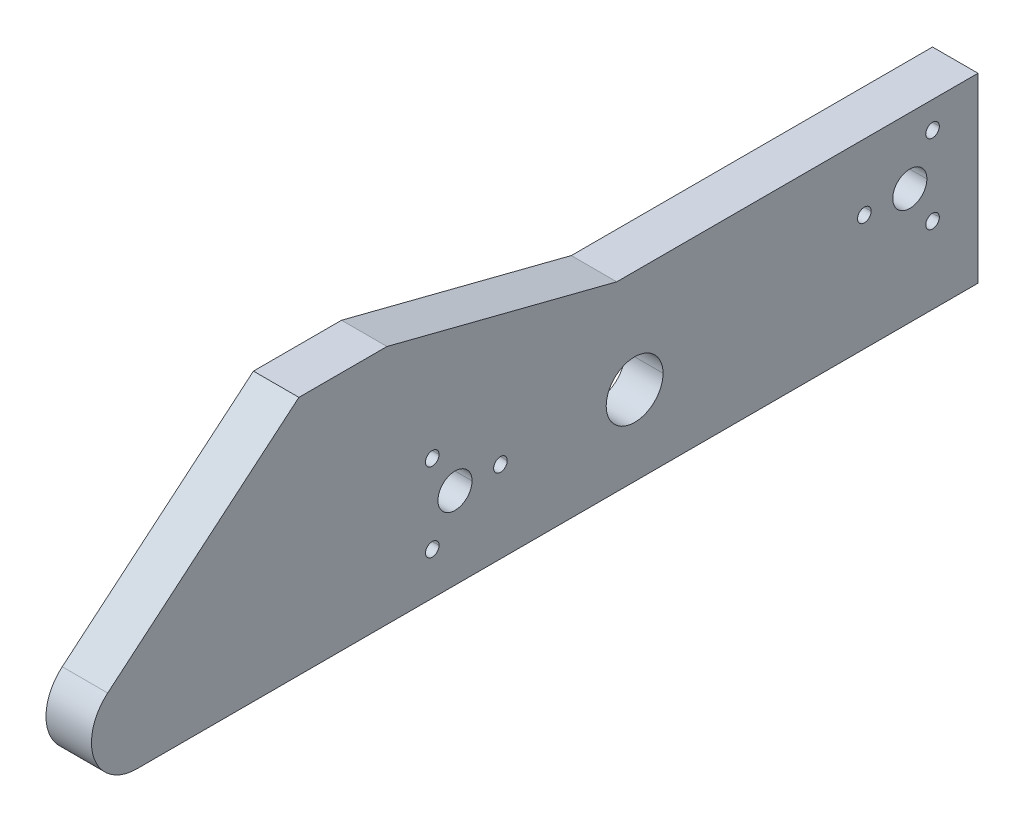
ISO-10303-21;
HEADER;
FILE_DESCRIPTION(('STEP AP214'),'2;1');
FILE_NAME('part.step','',(''),(''),'','','');
FILE_SCHEMA(('AUTOMOTIVE_DESIGN { 1 0 10303 214 1 1 1 1 }'));
ENDSEC;
DATA;
#1=APPLICATION_CONTEXT('core data for automotive mechanical design processes');
#2=APPLICATION_PROTOCOL_DEFINITION('international standard','automotive_design',2000,#1);
#3=PRODUCT_CONTEXT('',#1,'mechanical');
#4=PRODUCT('Part','Part','',(#3));
#5=PRODUCT_RELATED_PRODUCT_CATEGORY('part','',(#4));
#6=PRODUCT_DEFINITION_FORMATION('','',#4);
#7=PRODUCT_DEFINITION_CONTEXT('part definition',#1,'design');
#8=PRODUCT_DEFINITION('design','',#6,#7);
#9=PRODUCT_DEFINITION_SHAPE('','',#8);
#10=(LENGTH_UNIT() NAMED_UNIT(*) SI_UNIT(.MILLI.,.METRE.));
#11=(NAMED_UNIT(*) PLANE_ANGLE_UNIT() SI_UNIT($,.RADIAN.));
#12=(NAMED_UNIT(*) SI_UNIT($,.STERADIAN.) SOLID_ANGLE_UNIT());
#13=UNCERTAINTY_MEASURE_WITH_UNIT(LENGTH_MEASURE(1.E-05),#10,'distance_accuracy_value','');
#14=(GEOMETRIC_REPRESENTATION_CONTEXT(3) GLOBAL_UNCERTAINTY_ASSIGNED_CONTEXT((#13)) GLOBAL_UNIT_ASSIGNED_CONTEXT((#10,
#11,#12)) REPRESENTATION_CONTEXT('',''));
#15=CARTESIAN_POINT('',(0.,0.,0.));
#16=DIRECTION('',(0.,0.,1.));
#17=DIRECTION('',(1.,0.,0.));
#18=AXIS2_PLACEMENT_3D('',#15,#16,#17);
#19=CARTESIAN_POINT('',(208.574999918,-10.16,76.8697838803578));
#20=DIRECTION('',(-1.,0.,0.));
#21=DIRECTION('',(0.,0.,1.));
#22=AXIS2_PLACEMENT_3D('',#19,#20,#21);
#23=PLANE('',#22);
#24=CARTESIAN_POINT('',(208.574999918,-10.16,76.8697838803578));
#25=DIRECTION('',(-1.,0.,0.));
#26=DIRECTION('',(0.,0.,1.));
#27=AXIS2_PLACEMENT_3D('',#24,#25,#26);
#28=CIRCLE('',#27,7.9375);
#29=CARTESIAN_POINT('',(208.574999918,-10.16,84.8072838803578));
#30=VERTEX_POINT('',#29);
#31=CARTESIAN_POINT('',(208.574999918,-10.16,68.9322838803578));
#32=VERTEX_POINT('',#31);
#33=EDGE_CURVE('E278',#30,#32,#28,.T.);
#34=ORIENTED_EDGE('',*,*,#33,.F.);
#35=CARTESIAN_POINT('',(208.574999918,-10.16,76.8697838803578));
#36=DIRECTION('',(-1.,0.,0.));
#37=DIRECTION('',(0.,0.,1.));
#38=AXIS2_PLACEMENT_3D('',#35,#36,#37);
#39=CIRCLE('',#38,7.9375);
#40=EDGE_CURVE('E399',#32,#30,#39,.T.);
#41=ORIENTED_EDGE('',*,*,#40,.F.);
#42=EDGE_LOOP('',(#34,#41));
#43=FACE_BOUND('',#42,.T.);
#44=CARTESIAN_POINT('',(208.574999918,-10.16,76.8697838803578));
#45=DIRECTION('',(-1.,0.,0.));
#46=DIRECTION('',(0.,0.,1.));
#47=AXIS2_PLACEMENT_3D('',#44,#45,#46);
#48=CIRCLE('',#47,17.563500052);
#49=CARTESIAN_POINT('',(208.574999918,-10.16,94.4332839323578));
#50=VERTEX_POINT('',#49);
#51=CARTESIAN_POINT('',(208.574999918,-10.16,59.3062838283578));
#52=VERTEX_POINT('',#51);
#53=EDGE_CURVE('E10',#50,#52,#48,.T.);
#54=ORIENTED_EDGE('',*,*,#53,.T.);
#55=CARTESIAN_POINT('',(208.574999918,-10.16,76.8697838803578));
#56=DIRECTION('',(-1.,0.,0.));
#57=DIRECTION('',(0.,0.,1.));
#58=AXIS2_PLACEMENT_3D('',#55,#56,#57);
#59=CIRCLE('',#58,17.563500052);
#60=EDGE_CURVE('E469',#52,#50,#59,.T.);
#61=ORIENTED_EDGE('',*,*,#60,.T.);
#62=EDGE_LOOP('',(#54,#61));
#63=FACE_BOUND('',#62,.T.);
#64=ADVANCED_FACE('F15',(#43,#63),#23,.T.);
#65=CARTESIAN_POINT('',(208.574999918,-10.16,76.8697838803578));
#66=DIRECTION('',(-1.,0.,0.));
#67=DIRECTION('',(0.,0.,1.));
#68=AXIS2_PLACEMENT_3D('',#65,#66,#67);
#69=CYLINDRICAL_SURFACE('',#68,17.563500052);
#70=DIRECTION('',(-1.,0.,0.));
#71=VECTOR('',#70,1.);
#72=CARTESIAN_POINT('',(208.574999918,-10.16,59.3062838283578));
#73=LINE('',#72,#71);
#74=CARTESIAN_POINT('',(206.375,-10.16,59.3062838283578));
#75=VERTEX_POINT('',#74);
#76=EDGE_CURVE('E288',#52,#75,#73,.T.);
#77=ORIENTED_EDGE('',*,*,#76,.F.);
#78=ORIENTED_EDGE('',*,*,#53,.F.);
#79=DIRECTION('',(-1.,0.,0.));
#80=VECTOR('',#79,1.);
#81=CARTESIAN_POINT('',(208.574999918,-10.16,94.4332839323578));
#82=LINE('',#81,#80);
#83=CARTESIAN_POINT('',(206.375,-10.16,94.4332839323578));
#84=VERTEX_POINT('',#83);
#85=EDGE_CURVE('E287',#50,#84,#82,.T.);
#86=ORIENTED_EDGE('',*,*,#85,.T.);
#87=CARTESIAN_POINT('',(206.375,-10.16,76.8697838803578));
#88=DIRECTION('',(-1.,0.,0.));
#89=DIRECTION('',(0.,0.,1.));
#90=AXIS2_PLACEMENT_3D('',#87,#88,#89);
#91=CIRCLE('',#90,17.563500052);
#92=EDGE_CURVE('E342',#84,#75,#91,.T.);
#93=ORIENTED_EDGE('',*,*,#92,.T.);
#94=EDGE_LOOP('',(#77,#78,#86,#93));
#95=FACE_BOUND('',#94,.T.);
#96=ADVANCED_FACE('F496',(#95),#69,.F.);
#97=CARTESIAN_POINT('',(219.075,1.47352262806237,133.396275802921));
#98=DIRECTION('',(1.,0.,0.));
#99=DIRECTION('',(0.,0.,-1.));
#100=AXIS2_PLACEMENT_3D('',#97,#98,#99);
#101=CYLINDRICAL_SURFACE('',#100,1.89865);
#102=DIRECTION('',(1.,0.,0.));
#103=VECTOR('',#102,1.);
#104=CARTESIAN_POINT('',(219.075,1.47352262806237,135.294925802921));
#105=LINE('',#104,#103);
#106=CARTESIAN_POINT('',(206.375,1.47352262806237,135.294925802921));
#107=VERTEX_POINT('',#106);
#108=CARTESIAN_POINT('',(219.075,1.47352262806237,135.294925802921));
#109=VERTEX_POINT('',#108);
#110=EDGE_CURVE('E330',#107,#109,#105,.T.);
#111=ORIENTED_EDGE('',*,*,#110,.F.);
#112=CARTESIAN_POINT('',(206.375,1.47352262806237,133.396275802921));
#113=DIRECTION('',(-1.,0.,0.));
#114=DIRECTION('',(0.,0.,1.));
#115=AXIS2_PLACEMENT_3D('',#112,#113,#114);
#116=CIRCLE('',#115,1.89865);
#117=CARTESIAN_POINT('',(206.375,1.47352262806237,131.497625802921));
#118=VERTEX_POINT('',#117);
#119=EDGE_CURVE('E339',#107,#118,#116,.T.);
#120=ORIENTED_EDGE('',*,*,#119,.T.);
#121=DIRECTION('',(1.,0.,0.));
#122=VECTOR('',#121,1.);
#123=CARTESIAN_POINT('',(219.075,1.47352262806237,131.497625802921));
#124=LINE('',#123,#122);
#125=CARTESIAN_POINT('',(219.075,1.47352262806237,131.497625802921));
#126=VERTEX_POINT('',#125);
#127=EDGE_CURVE('E352',#118,#126,#124,.T.);
#128=ORIENTED_EDGE('',*,*,#127,.T.);
#129=CARTESIAN_POINT('',(219.075,1.47352262806237,133.396275802921));
#130=DIRECTION('',(1.,0.,0.));
#131=DIRECTION('',(0.,0.,-1.));
#132=AXIS2_PLACEMENT_3D('',#129,#130,#131);
#133=CIRCLE('',#132,1.89865);
#134=EDGE_CURVE('E259',#126,#109,#133,.T.);
#135=ORIENTED_EDGE('',*,*,#134,.T.);
#136=EDGE_LOOP('',(#111,#120,#128,#135));
#137=FACE_BOUND('',#136,.T.);
#138=ADVANCED_FACE('F1019',(#137),#101,.F.);
#139=CARTESIAN_POINT('',(219.075,-20.5235226280624,133.396275802921));
#140=DIRECTION('',(1.,0.,0.));
#141=DIRECTION('',(0.,0.,-1.));
#142=AXIS2_PLACEMENT_3D('',#139,#140,#141);
#143=CYLINDRICAL_SURFACE('',#142,1.89865);
#144=DIRECTION('',(1.,0.,0.));
#145=VECTOR('',#144,1.);
#146=CARTESIAN_POINT('',(219.075,-20.5235226280624,135.294925802921));
#147=LINE('',#146,#145);
#148=CARTESIAN_POINT('',(206.375,-20.5235226280624,135.294925802921));
#149=VERTEX_POINT('',#148);
#150=CARTESIAN_POINT('',(219.075,-20.5235226280624,135.294925802921));
#151=VERTEX_POINT('',#150);
#152=EDGE_CURVE('E373',#149,#151,#147,.T.);
#153=ORIENTED_EDGE('',*,*,#152,.F.);
#154=CARTESIAN_POINT('',(206.375,-20.5235226280624,133.396275802921));
#155=DIRECTION('',(-1.,0.,0.));
#156=DIRECTION('',(0.,0.,1.));
#157=AXIS2_PLACEMENT_3D('',#154,#155,#156);
#158=CIRCLE('',#157,1.89865);
#159=CARTESIAN_POINT('',(206.375,-20.5235226280624,131.497625802921));
#160=VERTEX_POINT('',#159);
#161=EDGE_CURVE('E341',#149,#160,#158,.T.);
#162=ORIENTED_EDGE('',*,*,#161,.T.);
#163=DIRECTION('',(1.,0.,0.));
#164=VECTOR('',#163,1.);
#165=CARTESIAN_POINT('',(219.075,-20.5235226280624,131.497625802921));
#166=LINE('',#165,#164);
#167=CARTESIAN_POINT('',(219.075,-20.5235226280624,131.497625802921));
#168=VERTEX_POINT('',#167);
#169=EDGE_CURVE('E433',#160,#168,#166,.T.);
#170=ORIENTED_EDGE('',*,*,#169,.T.);
#171=CARTESIAN_POINT('',(219.075,-20.5235226280624,133.396275802921));
#172=DIRECTION('',(1.,0.,0.));
#173=DIRECTION('',(0.,0.,-1.));
#174=AXIS2_PLACEMENT_3D('',#171,#172,#173);
#175=CIRCLE('',#174,1.89865);
#176=EDGE_CURVE('E440',#168,#151,#175,.T.);
#177=ORIENTED_EDGE('',*,*,#176,.T.);
#178=EDGE_LOOP('',(#153,#162,#170,#177));
#179=FACE_BOUND('',#178,.T.);
#180=ADVANCED_FACE('F791',(#179),#143,.F.);
#181=CARTESIAN_POINT('',(219.075,-9.525,114.346275802921));
#182=DIRECTION('',(1.,0.,0.));
#183=DIRECTION('',(0.,0.,-1.));
#184=AXIS2_PLACEMENT_3D('',#181,#182,#183);
#185=CYLINDRICAL_SURFACE('',#184,1.89865);
#186=DIRECTION('',(1.,0.,0.));
#187=VECTOR('',#186,1.);
#188=CARTESIAN_POINT('',(219.075,-9.525,116.244925802921));
#189=LINE('',#188,#187);
#190=CARTESIAN_POINT('',(206.375,-9.525,116.244925802921));
#191=VERTEX_POINT('',#190);
#192=CARTESIAN_POINT('',(219.075,-9.525,116.244925802921));
#193=VERTEX_POINT('',#192);
#194=EDGE_CURVE('E419',#191,#193,#189,.T.);
#195=ORIENTED_EDGE('',*,*,#194,.F.);
#196=CARTESIAN_POINT('',(206.375,-9.525,114.346275802921));
#197=DIRECTION('',(-1.,0.,0.));
#198=DIRECTION('',(0.,0.,1.));
#199=AXIS2_PLACEMENT_3D('',#196,#197,#198);
#200=CIRCLE('',#199,1.89865);
#201=CARTESIAN_POINT('',(206.375,-9.525,112.447625802921));
#202=VERTEX_POINT('',#201);
#203=EDGE_CURVE('E468',#191,#202,#200,.T.);
#204=ORIENTED_EDGE('',*,*,#203,.T.);
#205=DIRECTION('',(1.,0.,0.));
#206=VECTOR('',#205,1.);
#207=CARTESIAN_POINT('',(219.075,-9.525,112.447625802921));
#208=LINE('',#207,#206);
#209=CARTESIAN_POINT('',(219.075,-9.525,112.447625802921));
#210=VERTEX_POINT('',#209);
#211=EDGE_CURVE('E418',#202,#210,#208,.T.);
#212=ORIENTED_EDGE('',*,*,#211,.T.);
#213=CARTESIAN_POINT('',(219.075,-9.525,114.346275802921));
#214=DIRECTION('',(1.,0.,0.));
#215=DIRECTION('',(0.,0.,-1.));
#216=AXIS2_PLACEMENT_3D('',#213,#214,#215);
#217=CIRCLE('',#216,1.89865);
#218=EDGE_CURVE('E309',#210,#193,#217,.T.);
#219=ORIENTED_EDGE('',*,*,#218,.T.);
#220=EDGE_LOOP('',(#195,#204,#212,#219));
#221=FACE_BOUND('',#220,.T.);
#222=ADVANCED_FACE('F17',(#221),#185,.F.);
#223=CARTESIAN_POINT('',(219.075,10.9985226280624,-6.35));
#224=DIRECTION('',(1.,0.,0.));
#225=DIRECTION('',(0.,0.,-1.));
#226=AXIS2_PLACEMENT_3D('',#223,#224,#225);
#227=CYLINDRICAL_SURFACE('',#226,1.89865);
#228=DIRECTION('',(1.,0.,0.));
#229=VECTOR('',#228,1.);
#230=CARTESIAN_POINT('',(219.075,10.9985226280624,-4.45135));
#231=LINE('',#230,#229);
#232=CARTESIAN_POINT('',(206.375,10.9985226280624,-4.45135));
#233=VERTEX_POINT('',#232);
#234=CARTESIAN_POINT('',(219.075,10.9985226280624,-4.45135));
#235=VERTEX_POINT('',#234);
#236=EDGE_CURVE('E260',#233,#235,#231,.T.);
#237=ORIENTED_EDGE('',*,*,#236,.F.);
#238=CARTESIAN_POINT('',(206.375,10.9985226280624,-6.35));
#239=DIRECTION('',(-1.,0.,0.));
#240=DIRECTION('',(0.,0.,1.));
#241=AXIS2_PLACEMENT_3D('',#238,#239,#240);
#242=CIRCLE('',#241,1.89865);
#243=CARTESIAN_POINT('',(206.375,10.9985226280624,-8.24865));
#244=VERTEX_POINT('',#243);
#245=EDGE_CURVE('E324',#233,#244,#242,.T.);
#246=ORIENTED_EDGE('',*,*,#245,.T.);
#247=DIRECTION('',(1.,0.,0.));
#248=VECTOR('',#247,1.);
#249=CARTESIAN_POINT('',(219.075,10.9985226280624,-8.24865));
#250=LINE('',#249,#248);
#251=CARTESIAN_POINT('',(219.075,10.9985226280624,-8.24865));
#252=VERTEX_POINT('',#251);
#253=EDGE_CURVE('E289',#244,#252,#250,.T.);
#254=ORIENTED_EDGE('',*,*,#253,.T.);
#255=CARTESIAN_POINT('',(219.075,10.9985226280624,-6.35));
#256=DIRECTION('',(1.,0.,0.));
#257=DIRECTION('',(0.,0.,-1.));
#258=AXIS2_PLACEMENT_3D('',#255,#256,#257);
#259=CIRCLE('',#258,1.89865);
#260=EDGE_CURVE('E306',#252,#235,#259,.T.);
#261=ORIENTED_EDGE('',*,*,#260,.T.);
#262=EDGE_LOOP('',(#237,#246,#254,#261));
#263=FACE_BOUND('',#262,.T.);
#264=ADVANCED_FACE('F779',(#263),#227,.F.);
#265=CARTESIAN_POINT('',(219.075,0.,12.7));
#266=DIRECTION('',(1.,0.,0.));
#267=DIRECTION('',(0.,0.,-1.));
#268=AXIS2_PLACEMENT_3D('',#265,#266,#267);
#269=CYLINDRICAL_SURFACE('',#268,1.89865);
#270=DIRECTION('',(1.,0.,0.));
#271=VECTOR('',#270,1.);
#272=CARTESIAN_POINT('',(219.075,0.,14.59865));
#273=LINE('',#272,#271);
#274=CARTESIAN_POINT('',(206.375,0.,14.59865));
#275=VERTEX_POINT('',#274);
#276=CARTESIAN_POINT('',(219.075,0.,14.59865));
#277=VERTEX_POINT('',#276);
#278=EDGE_CURVE('E386',#275,#277,#273,.T.);
#279=ORIENTED_EDGE('',*,*,#278,.F.);
#280=CARTESIAN_POINT('',(206.375,0.,12.7));
#281=DIRECTION('',(-1.,0.,0.));
#282=DIRECTION('',(0.,0.,1.));
#283=AXIS2_PLACEMENT_3D('',#280,#281,#282);
#284=CIRCLE('',#283,1.89865);
#285=CARTESIAN_POINT('',(206.375,0.,10.80135));
#286=VERTEX_POINT('',#285);
#287=EDGE_CURVE('E320',#275,#286,#284,.T.);
#288=ORIENTED_EDGE('',*,*,#287,.T.);
#289=DIRECTION('',(1.,0.,0.));
#290=VECTOR('',#289,1.);
#291=CARTESIAN_POINT('',(219.075,0.,10.80135));
#292=LINE('',#291,#290);
#293=CARTESIAN_POINT('',(219.075,0.,10.80135));
#294=VERTEX_POINT('',#293);
#295=EDGE_CURVE('E266',#286,#294,#292,.T.);
#296=ORIENTED_EDGE('',*,*,#295,.T.);
#297=CARTESIAN_POINT('',(219.075,0.,12.7));
#298=DIRECTION('',(1.,0.,0.));
#299=DIRECTION('',(0.,0.,-1.));
#300=AXIS2_PLACEMENT_3D('',#297,#298,#299);
#301=CIRCLE('',#300,1.89865);
#302=EDGE_CURVE('E310',#294,#277,#301,.T.);
#303=ORIENTED_EDGE('',*,*,#302,.T.);
#304=EDGE_LOOP('',(#279,#288,#296,#303));
#305=FACE_BOUND('',#304,.T.);
#306=ADVANCED_FACE('F831',(#305),#269,.F.);
#307=CARTESIAN_POINT('',(219.075,-10.9985226280624,-6.35));
#308=DIRECTION('',(1.,0.,0.));
#309=DIRECTION('',(0.,0.,-1.));
#310=AXIS2_PLACEMENT_3D('',#307,#308,#309);
#311=CYLINDRICAL_SURFACE('',#310,1.89865);
#312=DIRECTION('',(1.,0.,0.));
#313=VECTOR('',#312,1.);
#314=CARTESIAN_POINT('',(219.075,-10.9985226280624,-4.45135));
#315=LINE('',#314,#313);
#316=CARTESIAN_POINT('',(206.375,-10.9985226280624,-4.45135));
#317=VERTEX_POINT('',#316);
#318=CARTESIAN_POINT('',(219.075,-10.9985226280624,-4.45135));
#319=VERTEX_POINT('',#318);
#320=EDGE_CURVE('E351',#317,#319,#315,.T.);
#321=ORIENTED_EDGE('',*,*,#320,.F.);
#322=CARTESIAN_POINT('',(206.375,-10.9985226280624,-6.35));
#323=DIRECTION('',(-1.,0.,0.));
#324=DIRECTION('',(0.,0.,1.));
#325=AXIS2_PLACEMENT_3D('',#322,#323,#324);
#326=CIRCLE('',#325,1.89865);
#327=CARTESIAN_POINT('',(206.375,-10.9985226280624,-8.24865));
#328=VERTEX_POINT('',#327);
#329=EDGE_CURVE('E323',#317,#328,#326,.T.);
#330=ORIENTED_EDGE('',*,*,#329,.T.);
#331=DIRECTION('',(1.,0.,0.));
#332=VECTOR('',#331,1.);
#333=CARTESIAN_POINT('',(219.075,-10.9985226280624,-8.24865));
#334=LINE('',#333,#332);
#335=CARTESIAN_POINT('',(219.075,-10.9985226280624,-8.24865));
#336=VERTEX_POINT('',#335);
#337=EDGE_CURVE('E272',#328,#336,#334,.T.);
#338=ORIENTED_EDGE('',*,*,#337,.T.);
#339=CARTESIAN_POINT('',(219.075,-10.9985226280624,-6.35));
#340=DIRECTION('',(1.,0.,0.));
#341=DIRECTION('',(0.,0.,-1.));
#342=AXIS2_PLACEMENT_3D('',#339,#340,#341);
#343=CIRCLE('',#342,1.89865);
#344=EDGE_CURVE('E413',#336,#319,#343,.T.);
#345=ORIENTED_EDGE('',*,*,#344,.T.);
#346=EDGE_LOOP('',(#321,#330,#338,#345));
#347=FACE_BOUND('',#346,.T.);
#348=ADVANCED_FACE('F955',(#347),#311,.F.);
#349=CARTESIAN_POINT('',(99.9028769123266,-19.685,215.9));
#350=DIRECTION('',(1.,0.,0.));
#351=DIRECTION('',(0.,0.,-1.));
#352=AXIS2_PLACEMENT_3D('',#349,#350,#351);
#353=CYLINDRICAL_SURFACE('',#352,12.7);
#354=DIRECTION('',(1.,0.,0.));
#355=VECTOR('',#354,1.);
#356=CARTESIAN_POINT('',(99.9028769123266,-9.95623557238899,224.063402643019));
#357=LINE('',#356,#355);
#358=CARTESIAN_POINT('',(206.375,-9.95623557238899,224.063402643019));
#359=VERTEX_POINT('',#358);
#360=CARTESIAN_POINT('',(219.075,-9.95623557238899,224.063402643019));
#361=VERTEX_POINT('',#360);
#362=EDGE_CURVE('E26',#359,#361,#357,.T.);
#363=ORIENTED_EDGE('',*,*,#362,.F.);
#364=CARTESIAN_POINT('',(206.375,-19.685,215.9));
#365=DIRECTION('',(1.,0.,0.));
#366=DIRECTION('',(0.,0.,1.));
#367=AXIS2_PLACEMENT_3D('',#364,#365,#366);
#368=CIRCLE('',#367,12.7);
#369=CARTESIAN_POINT('',(206.375,-32.385,215.9));
#370=VERTEX_POINT('',#369);
#371=EDGE_CURVE('E298',#359,#370,#368,.T.);
#372=ORIENTED_EDGE('',*,*,#371,.T.);
#373=DIRECTION('',(1.,0.,0.));
#374=VECTOR('',#373,1.);
#375=CARTESIAN_POINT('',(99.9028769123266,-32.385,215.9));
#376=LINE('',#375,#374);
#377=CARTESIAN_POINT('',(219.075,-32.385,215.9));
#378=VERTEX_POINT('',#377);
#379=EDGE_CURVE('E230',#370,#378,#376,.T.);
#380=ORIENTED_EDGE('',*,*,#379,.T.);
#381=CARTESIAN_POINT('',(219.075,-19.685,215.9));
#382=DIRECTION('',(1.,0.,0.));
#383=DIRECTION('',(0.,0.,1.));
#384=AXIS2_PLACEMENT_3D('',#381,#382,#383);
#385=CIRCLE('',#384,12.7);
#386=EDGE_CURVE('E227',#361,#378,#385,.T.);
#387=ORIENTED_EDGE('',*,*,#386,.F.);
#388=EDGE_LOOP('',(#363,#372,#380,#387));
#389=FACE_BOUND('',#388,.T.);
#390=ADVANCED_FACE('F228',(#389),#353,.T.);
#391=CARTESIAN_POINT('',(99.9028769123266,-9.95623557238899,224.063402643019));
#392=DIRECTION('',(0.,0.766044443118982,0.642787609686535));
#393=DIRECTION('',(1.,0.,0.));
#394=AXIS2_PLACEMENT_3D('',#391,#392,#393);
#395=PLANE('',#394);
#396=DIRECTION('',(1.,0.,0.));
#397=VECTOR('',#396,1.);
#398=CARTESIAN_POINT('',(99.9028769123266,34.8594086508066,170.654197635601));
#399=LINE('',#398,#397);
#400=CARTESIAN_POINT('',(206.375,34.8594086508066,170.654197635601));
#401=VERTEX_POINT('',#400);
#402=CARTESIAN_POINT('',(219.075,34.8594086508066,170.654197635601));
#403=VERTEX_POINT('',#402);
#404=EDGE_CURVE('E224',#401,#403,#399,.T.);
#405=ORIENTED_EDGE('',*,*,#404,.F.);
#406=DIRECTION('',(0.,-0.642787609686535,0.766044443118981));
#407=VECTOR('',#406,1.);
#408=CARTESIAN_POINT('',(206.375,-9.95623557238899,224.063402643019));
#409=LINE('',#408,#407);
#410=EDGE_CURVE('E219',#401,#359,#409,.T.);
#411=ORIENTED_EDGE('',*,*,#410,.T.);
#412=ORIENTED_EDGE('',*,*,#362,.T.);
#413=DIRECTION('',(0.,-0.642787609686535,0.766044443118981));
#414=VECTOR('',#413,1.);
#415=CARTESIAN_POINT('',(219.075,-9.95623557238899,224.063402643019));
#416=LINE('',#415,#414);
#417=EDGE_CURVE('E216',#403,#361,#416,.T.);
#418=ORIENTED_EDGE('',*,*,#417,.F.);
#419=EDGE_LOOP('',(#405,#411,#412,#418));
#420=FACE_BOUND('',#419,.T.);
#421=ADVANCED_FACE('F214',(#420),#395,.T.);
#422=CARTESIAN_POINT('',(99.9028769123266,34.8594086508066,146.05));
#423=DIRECTION('',(0.,1.,0.));
#424=DIRECTION('',(1.,0.,0.));
#425=AXIS2_PLACEMENT_3D('',#422,#423,#424);
#426=PLANE('',#425);
#427=DIRECTION('',(-1.,0.,0.));
#428=VECTOR('',#427,1.);
#429=CARTESIAN_POINT('',(219.075,34.8594086508066,146.05));
#430=LINE('',#429,#428);
#431=CARTESIAN_POINT('',(219.075,34.8594086508066,146.05));
#432=VERTEX_POINT('',#431);
#433=CARTESIAN_POINT('',(206.375,34.8594086508066,146.05));
#434=VERTEX_POINT('',#433);
#435=EDGE_CURVE('E316',#432,#434,#430,.T.);
#436=ORIENTED_EDGE('',*,*,#435,.T.);
#437=DIRECTION('',(0.,0.,1.));
#438=VECTOR('',#437,1.);
#439=CARTESIAN_POINT('',(206.375,34.8594086508066,146.05));
#440=LINE('',#439,#438);
#441=EDGE_CURVE('E361',#434,#401,#440,.T.);
#442=ORIENTED_EDGE('',*,*,#441,.T.);
#443=ORIENTED_EDGE('',*,*,#404,.T.);
#444=DIRECTION('',(0.,0.,1.));
#445=VECTOR('',#444,1.);
#446=CARTESIAN_POINT('',(219.075,34.8594086508066,146.05));
#447=LINE('',#446,#445);
#448=EDGE_CURVE('E241',#432,#403,#447,.T.);
#449=ORIENTED_EDGE('',*,*,#448,.F.);
#450=EDGE_LOOP('',(#436,#442,#443,#449));
#451=FACE_BOUND('',#450,.T.);
#452=ADVANCED_FACE('F901',(#451),#426,.T.);
#453=CARTESIAN_POINT('',(219.075,0.,0.));
#454=DIRECTION('',(-1.,0.,0.));
#455=DIRECTION('',(0.,0.,1.));
#456=AXIS2_PLACEMENT_3D('',#453,#454,#455);
#457=CYLINDRICAL_SURFACE('',#456,4.7625);
#458=DIRECTION('',(-1.,0.,0.));
#459=VECTOR('',#458,1.);
#460=CARTESIAN_POINT('',(219.075,0.,-4.7625));
#461=LINE('',#460,#459);
#462=CARTESIAN_POINT('',(219.075,0.,-4.7625));
#463=VERTEX_POINT('',#462);
#464=CARTESIAN_POINT('',(206.375,0.,-4.7625));
#465=VERTEX_POINT('',#464);
#466=EDGE_CURVE('E314',#463,#465,#461,.T.);
#467=ORIENTED_EDGE('',*,*,#466,.F.);
#468=CARTESIAN_POINT('',(219.075,0.,0.));
#469=DIRECTION('',(1.,0.,0.));
#470=DIRECTION('',(0.,0.,-1.));
#471=AXIS2_PLACEMENT_3D('',#468,#469,#470);
#472=CIRCLE('',#471,4.7625);
#473=CARTESIAN_POINT('',(219.075,0.,4.7625));
#474=VERTEX_POINT('',#473);
#475=EDGE_CURVE('E19',#463,#474,#472,.T.);
#476=ORIENTED_EDGE('',*,*,#475,.T.);
#477=DIRECTION('',(-1.,0.,0.));
#478=VECTOR('',#477,1.);
#479=CARTESIAN_POINT('',(219.075,0.,4.7625));
#480=LINE('',#479,#478);
#481=CARTESIAN_POINT('',(206.375,0.,4.7625));
#482=VERTEX_POINT('',#481);
#483=EDGE_CURVE('E329',#474,#482,#480,.T.);
#484=ORIENTED_EDGE('',*,*,#483,.T.);
#485=CARTESIAN_POINT('',(206.375,0.,0.));
#486=DIRECTION('',(1.,0.,0.));
#487=DIRECTION('',(0.,0.,-1.));
#488=AXIS2_PLACEMENT_3D('',#485,#486,#487);
#489=CIRCLE('',#488,4.7625);
#490=EDGE_CURVE('E252',#465,#482,#489,.T.);
#491=ORIENTED_EDGE('',*,*,#490,.F.);
#492=EDGE_LOOP('',(#467,#476,#484,#491));
#493=FACE_BOUND('',#492,.T.);
#494=ADVANCED_FACE('F944',(#493),#457,.F.);
#495=CARTESIAN_POINT('',(219.075,-9.525,127.046275802921));
#496=DIRECTION('',(-1.,0.,0.));
#497=DIRECTION('',(0.,0.,1.));
#498=AXIS2_PLACEMENT_3D('',#495,#496,#497);
#499=CYLINDRICAL_SURFACE('',#498,4.7625);
#500=DIRECTION('',(-1.,0.,0.));
#501=VECTOR('',#500,1.);
#502=CARTESIAN_POINT('',(219.075,-9.525,122.283775802921));
#503=LINE('',#502,#501);
#504=CARTESIAN_POINT('',(219.075,-9.525,122.283775802921));
#505=VERTEX_POINT('',#504);
#506=CARTESIAN_POINT('',(206.375,-9.525,122.283775802921));
#507=VERTEX_POINT('',#506);
#508=EDGE_CURVE('E723',#505,#507,#503,.T.);
#509=ORIENTED_EDGE('',*,*,#508,.F.);
#510=CARTESIAN_POINT('',(219.075,-9.525,127.046275802921));
#511=DIRECTION('',(1.,0.,0.));
#512=DIRECTION('',(0.,0.,-1.));
#513=AXIS2_PLACEMENT_3D('',#510,#511,#512);
#514=CIRCLE('',#513,4.7625);
#515=CARTESIAN_POINT('',(219.075,-9.525,131.808775802921));
#516=VERTEX_POINT('',#515);
#517=EDGE_CURVE('E376',#505,#516,#514,.T.);
#518=ORIENTED_EDGE('',*,*,#517,.T.);
#519=DIRECTION('',(-1.,0.,0.));
#520=VECTOR('',#519,1.);
#521=CARTESIAN_POINT('',(219.075,-9.525,131.808775802921));
#522=LINE('',#521,#520);
#523=CARTESIAN_POINT('',(206.375,-9.525,131.808775802921));
#524=VERTEX_POINT('',#523);
#525=EDGE_CURVE('E367',#516,#524,#522,.T.);
#526=ORIENTED_EDGE('',*,*,#525,.T.);
#527=CARTESIAN_POINT('',(206.375,-9.525,127.046275802921));
#528=DIRECTION('',(1.,0.,0.));
#529=DIRECTION('',(0.,0.,-1.));
#530=AXIS2_PLACEMENT_3D('',#527,#528,#529);
#531=CIRCLE('',#530,4.7625);
#532=EDGE_CURVE('E305',#507,#524,#531,.T.);
#533=ORIENTED_EDGE('',*,*,#532,.F.);
#534=EDGE_LOOP('',(#509,#518,#526,#533));
#535=FACE_BOUND('',#534,.T.);
#536=ADVANCED_FACE('F720',(#535),#499,.F.);
#537=CARTESIAN_POINT('',(219.075,-32.385,-19.05));
#538=DIRECTION('',(0.,1.,0.));
#539=DIRECTION('',(0.,0.,-1.));
#540=AXIS2_PLACEMENT_3D('',#537,#538,#539);
#541=PLANE('',#540);
#542=DIRECTION('',(0.,0.,-1.));
#543=VECTOR('',#542,1.);
#544=CARTESIAN_POINT('',(206.375,-32.385,-19.05));
#545=LINE('',#544,#543);
#546=CARTESIAN_POINT('',(206.375,-32.385,-19.05));
#547=VERTEX_POINT('',#546);
#548=EDGE_CURVE('E258',#370,#547,#545,.T.);
#549=ORIENTED_EDGE('',*,*,#548,.T.);
#550=DIRECTION('',(-1.,0.,0.));
#551=VECTOR('',#550,1.);
#552=CARTESIAN_POINT('',(219.075,-32.385,-19.05));
#553=LINE('',#552,#551);
#554=CARTESIAN_POINT('',(219.075,-32.385,-19.05));
#555=VERTEX_POINT('',#554);
#556=EDGE_CURVE('E304',#555,#547,#553,.T.);
#557=ORIENTED_EDGE('',*,*,#556,.F.);
#558=DIRECTION('',(0.,0.,-1.));
#559=VECTOR('',#558,1.);
#560=CARTESIAN_POINT('',(219.075,-32.385,-19.05));
#561=LINE('',#560,#559);
#562=EDGE_CURVE('E235',#378,#555,#561,.T.);
#563=ORIENTED_EDGE('',*,*,#562,.F.);
#564=ORIENTED_EDGE('',*,*,#379,.F.);
#565=EDGE_LOOP('',(#549,#557,#563,#564));
#566=FACE_BOUND('',#565,.T.);
#567=ADVANCED_FACE('F516',(#566),#541,.F.);
#568=CARTESIAN_POINT('',(219.075,18.415,81.8536178572017));
#569=DIRECTION('',(0.,-0.968722661352191,0.248145935656274));
#570=DIRECTION('',(-1.,0.,0.));
#571=AXIS2_PLACEMENT_3D('',#568,#569,#570);
#572=PLANE('',#571);
#573=DIRECTION('',(0.,0.248145935656274,0.968722661352191));
#574=VECTOR('',#573,1.);
#575=CARTESIAN_POINT('',(206.375,18.415,81.8536178572017));
#576=LINE('',#575,#574);
#577=CARTESIAN_POINT('',(206.375,18.415,81.8536178572017));
#578=VERTEX_POINT('',#577);
#579=EDGE_CURVE('E357',#578,#434,#576,.T.);
#580=ORIENTED_EDGE('',*,*,#579,.T.);
#581=ORIENTED_EDGE('',*,*,#435,.F.);
#582=DIRECTION('',(0.,0.248145935656274,0.968722661352191));
#583=VECTOR('',#582,1.);
#584=CARTESIAN_POINT('',(219.075,18.415,81.8536178572017));
#585=LINE('',#584,#583);
#586=CARTESIAN_POINT('',(219.075,18.415,81.8536178572017));
#587=VERTEX_POINT('',#586);
#588=EDGE_CURVE('E248',#587,#432,#585,.T.);
#589=ORIENTED_EDGE('',*,*,#588,.F.);
#590=DIRECTION('',(-1.,0.,0.));
#591=VECTOR('',#590,1.);
#592=CARTESIAN_POINT('',(219.075,18.415,81.8536178572017));
#593=LINE('',#592,#591);
#594=EDGE_CURVE('E41',#587,#578,#593,.T.);
#595=ORIENTED_EDGE('',*,*,#594,.T.);
#596=EDGE_LOOP('',(#580,#581,#589,#595));
#597=FACE_BOUND('',#596,.T.);
#598=ADVANCED_FACE('F801',(#597),#572,.F.);
#599=CARTESIAN_POINT('',(219.075,18.415,81.8536178572017));
#600=DIRECTION('',(0.,-1.,0.));
#601=DIRECTION('',(0.,0.,-1.));
#602=AXIS2_PLACEMENT_3D('',#599,#600,#601);
#603=PLANE('',#602);
#604=DIRECTION('',(0.,0.,1.));
#605=VECTOR('',#604,1.);
#606=CARTESIAN_POINT('',(206.375,18.415,81.8536178572017));
#607=LINE('',#606,#605);
#608=CARTESIAN_POINT('',(206.375,18.415,-19.05));
#609=VERTEX_POINT('',#608);
#610=EDGE_CURVE('E360',#609,#578,#607,.T.);
#611=ORIENTED_EDGE('',*,*,#610,.T.);
#612=ORIENTED_EDGE('',*,*,#594,.F.);
#613=DIRECTION('',(0.,0.,1.));
#614=VECTOR('',#613,1.);
#615=CARTESIAN_POINT('',(219.075,18.415,81.8536178572017));
#616=LINE('',#615,#614);
#617=CARTESIAN_POINT('',(219.075,18.415,-19.05));
#618=VERTEX_POINT('',#617);
#619=EDGE_CURVE('E294',#618,#587,#616,.T.);
#620=ORIENTED_EDGE('',*,*,#619,.F.);
#621=DIRECTION('',(-1.,0.,0.));
#622=VECTOR('',#621,1.);
#623=CARTESIAN_POINT('',(219.075,18.415,-19.05));
#624=LINE('',#623,#622);
#625=EDGE_CURVE('E301',#618,#609,#624,.T.);
#626=ORIENTED_EDGE('',*,*,#625,.T.);
#627=EDGE_LOOP('',(#611,#612,#620,#626));
#628=FACE_BOUND('',#627,.T.);
#629=ADVANCED_FACE('F806',(#628),#603,.F.);
#630=CARTESIAN_POINT('',(219.075,-32.385,-19.05));
#631=DIRECTION('',(0.,0.,1.));
#632=DIRECTION('',(0.,-1.,0.));
#633=AXIS2_PLACEMENT_3D('',#630,#631,#632);
#634=PLANE('',#633);
#635=DIRECTION('',(0.,1.,0.));
#636=VECTOR('',#635,1.);
#637=CARTESIAN_POINT('',(206.375,-32.385,-19.05));
#638=LINE('',#637,#636);
#639=EDGE_CURVE('E254',#547,#609,#638,.T.);
#640=ORIENTED_EDGE('',*,*,#639,.T.);
#641=ORIENTED_EDGE('',*,*,#625,.F.);
#642=DIRECTION('',(0.,1.,0.));
#643=VECTOR('',#642,1.);
#644=CARTESIAN_POINT('',(219.075,-32.385,-19.05));
#645=LINE('',#644,#643);
#646=EDGE_CURVE('E281',#555,#618,#645,.T.);
#647=ORIENTED_EDGE('',*,*,#646,.F.);
#648=ORIENTED_EDGE('',*,*,#556,.T.);
#649=EDGE_LOOP('',(#640,#641,#647,#648));
#650=FACE_BOUND('',#649,.T.);
#651=ADVANCED_FACE('F502',(#650),#634,.F.);
#652=CARTESIAN_POINT('',(206.375,0.,0.));
#653=DIRECTION('',(-1.,0.,0.));
#654=DIRECTION('',(0.,0.,1.));
#655=AXIS2_PLACEMENT_3D('',#652,#653,#654);
#656=PLANE('',#655);
#657=CARTESIAN_POINT('',(206.375,-9.525,127.046275802921));
#658=DIRECTION('',(1.,0.,0.));
#659=DIRECTION('',(0.,0.,-1.));
#660=AXIS2_PLACEMENT_3D('',#657,#658,#659);
#661=CIRCLE('',#660,4.7625);
#662=EDGE_CURVE('E385',#524,#507,#661,.T.);
#663=ORIENTED_EDGE('',*,*,#662,.T.);
#664=ORIENTED_EDGE('',*,*,#532,.T.);
#665=EDGE_LOOP('',(#663,#664));
#666=FACE_BOUND('',#665,.T.);
#667=CARTESIAN_POINT('',(206.375,0.,0.));
#668=DIRECTION('',(1.,0.,0.));
#669=DIRECTION('',(0.,0.,-1.));
#670=AXIS2_PLACEMENT_3D('',#667,#668,#669);
#671=CIRCLE('',#670,4.7625);
#672=EDGE_CURVE('E325',#482,#465,#671,.T.);
#673=ORIENTED_EDGE('',*,*,#672,.T.);
#674=ORIENTED_EDGE('',*,*,#490,.T.);
#675=EDGE_LOOP('',(#673,#674));
#676=FACE_BOUND('',#675,.T.);
#677=CARTESIAN_POINT('',(206.375,-10.9985226280624,-6.35));
#678=DIRECTION('',(-1.,0.,0.));
#679=DIRECTION('',(0.,0.,1.));
#680=AXIS2_PLACEMENT_3D('',#677,#678,#679);
#681=CIRCLE('',#680,1.89865);
#682=EDGE_CURVE('E270',#328,#317,#681,.T.);
#683=ORIENTED_EDGE('',*,*,#682,.F.);
#684=ORIENTED_EDGE('',*,*,#329,.F.);
#685=EDGE_LOOP('',(#683,#684));
#686=FACE_BOUND('',#685,.T.);
#687=CARTESIAN_POINT('',(206.375,0.,12.7));
#688=DIRECTION('',(-1.,0.,0.));
#689=DIRECTION('',(0.,0.,1.));
#690=AXIS2_PLACEMENT_3D('',#687,#688,#689);
#691=CIRCLE('',#690,1.89865);
#692=EDGE_CURVE('E293',#286,#275,#691,.T.);
#693=ORIENTED_EDGE('',*,*,#692,.F.);
#694=ORIENTED_EDGE('',*,*,#287,.F.);
#695=EDGE_LOOP('',(#693,#694));
#696=FACE_BOUND('',#695,.T.);
#697=CARTESIAN_POINT('',(206.375,10.9985226280624,-6.35));
#698=DIRECTION('',(-1.,0.,0.));
#699=DIRECTION('',(0.,0.,1.));
#700=AXIS2_PLACEMENT_3D('',#697,#698,#699);
#701=CIRCLE('',#700,1.89865);
#702=EDGE_CURVE('E265',#244,#233,#701,.T.);
#703=ORIENTED_EDGE('',*,*,#702,.F.);
#704=ORIENTED_EDGE('',*,*,#245,.F.);
#705=EDGE_LOOP('',(#703,#704));
#706=FACE_BOUND('',#705,.T.);
#707=CARTESIAN_POINT('',(206.375,-9.525,114.346275802921));
#708=DIRECTION('',(-1.,0.,0.));
#709=DIRECTION('',(0.,0.,1.));
#710=AXIS2_PLACEMENT_3D('',#707,#708,#709);
#711=CIRCLE('',#710,1.89865);
#712=EDGE_CURVE('E437',#202,#191,#711,.T.);
#713=ORIENTED_EDGE('',*,*,#712,.F.);
#714=ORIENTED_EDGE('',*,*,#203,.F.);
#715=EDGE_LOOP('',(#713,#714));
#716=FACE_BOUND('',#715,.T.);
#717=CARTESIAN_POINT('',(206.375,-20.5235226280624,133.396275802921));
#718=DIRECTION('',(-1.,0.,0.));
#719=DIRECTION('',(0.,0.,1.));
#720=AXIS2_PLACEMENT_3D('',#717,#718,#719);
#721=CIRCLE('',#720,1.89865);
#722=EDGE_CURVE('E356',#160,#149,#721,.T.);
#723=ORIENTED_EDGE('',*,*,#722,.F.);
#724=ORIENTED_EDGE('',*,*,#161,.F.);
#725=EDGE_LOOP('',(#723,#724));
#726=FACE_BOUND('',#725,.T.);
#727=CARTESIAN_POINT('',(206.375,1.47352262806237,133.396275802921));
#728=DIRECTION('',(-1.,0.,0.));
#729=DIRECTION('',(0.,0.,1.));
#730=AXIS2_PLACEMENT_3D('',#727,#728,#729);
#731=CIRCLE('',#730,1.89865);
#732=EDGE_CURVE('E335',#118,#107,#731,.T.);
#733=ORIENTED_EDGE('',*,*,#732,.F.);
#734=ORIENTED_EDGE('',*,*,#119,.F.);
#735=EDGE_LOOP('',(#733,#734));
#736=FACE_BOUND('',#735,.T.);
#737=ORIENTED_EDGE('',*,*,#92,.F.);
#738=CARTESIAN_POINT('',(206.375,-10.16,76.8697838803578));
#739=DIRECTION('',(-1.,0.,0.));
#740=DIRECTION('',(0.,0.,1.));
#741=AXIS2_PLACEMENT_3D('',#738,#739,#740);
#742=CIRCLE('',#741,17.563500052);
#743=EDGE_CURVE('E283',#75,#84,#742,.T.);
#744=ORIENTED_EDGE('',*,*,#743,.F.);
#745=EDGE_LOOP('',(#737,#744));
#746=FACE_BOUND('',#745,.T.);
#747=ORIENTED_EDGE('',*,*,#639,.F.);
#748=ORIENTED_EDGE('',*,*,#548,.F.);
#749=ORIENTED_EDGE('',*,*,#371,.F.);
#750=ORIENTED_EDGE('',*,*,#410,.F.);
#751=ORIENTED_EDGE('',*,*,#441,.F.);
#752=ORIENTED_EDGE('',*,*,#579,.F.);
#753=ORIENTED_EDGE('',*,*,#610,.F.);
#754=EDGE_LOOP('',(#747,#748,#749,#750,#751,#752,#753));
#755=FACE_BOUND('',#754,.T.);
#756=ADVANCED_FACE('F499',(#666,#676,#686,#696,#706,#716,#726,#736,#746,#755),#656,.T.);
#757=CARTESIAN_POINT('',(219.075,0.,0.));
#758=DIRECTION('',(-1.,0.,0.));
#759=DIRECTION('',(0.,0.,1.));
#760=AXIS2_PLACEMENT_3D('',#757,#758,#759);
#761=PLANE('',#760);
#762=ORIENTED_EDGE('',*,*,#134,.F.);
#763=CARTESIAN_POINT('',(219.075,1.47352262806237,133.396275802921));
#764=DIRECTION('',(1.,0.,0.));
#765=DIRECTION('',(0.,0.,-1.));
#766=AXIS2_PLACEMENT_3D('',#763,#764,#765);
#767=CIRCLE('',#766,1.89865);
#768=EDGE_CURVE('E334',#109,#126,#767,.T.);
#769=ORIENTED_EDGE('',*,*,#768,.F.);
#770=EDGE_LOOP('',(#762,#769));
#771=FACE_BOUND('',#770,.T.);
#772=ORIENTED_EDGE('',*,*,#176,.F.);
#773=CARTESIAN_POINT('',(219.075,-20.5235226280624,133.396275802921));
#774=DIRECTION('',(1.,0.,0.));
#775=DIRECTION('',(0.,0.,-1.));
#776=AXIS2_PLACEMENT_3D('',#773,#774,#775);
#777=CIRCLE('',#776,1.89865);
#778=EDGE_CURVE('E406',#151,#168,#777,.T.);
#779=ORIENTED_EDGE('',*,*,#778,.F.);
#780=EDGE_LOOP('',(#772,#779));
#781=FACE_BOUND('',#780,.T.);
#782=ORIENTED_EDGE('',*,*,#218,.F.);
#783=CARTESIAN_POINT('',(219.075,-9.525,114.346275802921));
#784=DIRECTION('',(1.,0.,0.));
#785=DIRECTION('',(0.,0.,-1.));
#786=AXIS2_PLACEMENT_3D('',#783,#784,#785);
#787=CIRCLE('',#786,1.89865);
#788=EDGE_CURVE('E414',#193,#210,#787,.T.);
#789=ORIENTED_EDGE('',*,*,#788,.F.);
#790=EDGE_LOOP('',(#782,#789));
#791=FACE_BOUND('',#790,.T.);
#792=ORIENTED_EDGE('',*,*,#260,.F.);
#793=CARTESIAN_POINT('',(219.075,10.9985226280624,-6.35));
#794=DIRECTION('',(1.,0.,0.));
#795=DIRECTION('',(0.,0.,-1.));
#796=AXIS2_PLACEMENT_3D('',#793,#794,#795);
#797=CIRCLE('',#796,1.89865);
#798=EDGE_CURVE('E264',#235,#252,#797,.T.);
#799=ORIENTED_EDGE('',*,*,#798,.F.);
#800=EDGE_LOOP('',(#792,#799));
#801=FACE_BOUND('',#800,.T.);
#802=ORIENTED_EDGE('',*,*,#302,.F.);
#803=CARTESIAN_POINT('',(219.075,0.,12.7));
#804=DIRECTION('',(1.,0.,0.));
#805=DIRECTION('',(0.,0.,-1.));
#806=AXIS2_PLACEMENT_3D('',#803,#804,#805);
#807=CIRCLE('',#806,1.89865);
#808=EDGE_CURVE('E271',#277,#294,#807,.T.);
#809=ORIENTED_EDGE('',*,*,#808,.F.);
#810=EDGE_LOOP('',(#802,#809));
#811=FACE_BOUND('',#810,.T.);
#812=ORIENTED_EDGE('',*,*,#344,.F.);
#813=CARTESIAN_POINT('',(219.075,-10.9985226280624,-6.35));
#814=DIRECTION('',(1.,0.,0.));
#815=DIRECTION('',(0.,0.,-1.));
#816=AXIS2_PLACEMENT_3D('',#813,#814,#815);
#817=CIRCLE('',#816,1.89865);
#818=EDGE_CURVE('E277',#319,#336,#817,.T.);
#819=ORIENTED_EDGE('',*,*,#818,.F.);
#820=EDGE_LOOP('',(#812,#819));
#821=FACE_BOUND('',#820,.T.);
#822=CARTESIAN_POINT('',(219.075,-10.16,76.8697838803578));
#823=DIRECTION('',(1.,0.,0.));
#824=DIRECTION('',(0.,0.,-1.));
#825=AXIS2_PLACEMENT_3D('',#822,#823,#824);
#826=CIRCLE('',#825,7.9375);
#827=CARTESIAN_POINT('',(219.075,-10.16,84.8072838803578));
#828=VERTEX_POINT('',#827);
#829=CARTESIAN_POINT('',(219.075,-10.16,68.9322838803578));
#830=VERTEX_POINT('',#829);
#831=EDGE_CURVE('E362',#828,#830,#826,.T.);
#832=ORIENTED_EDGE('',*,*,#831,.F.);
#833=CARTESIAN_POINT('',(219.075,-10.16,76.8697838803578));
#834=DIRECTION('',(1.,0.,0.));
#835=DIRECTION('',(0.,0.,-1.));
#836=AXIS2_PLACEMENT_3D('',#833,#834,#835);
#837=CIRCLE('',#836,7.9375);
#838=EDGE_CURVE('E282',#830,#828,#837,.T.);
#839=ORIENTED_EDGE('',*,*,#838,.F.);
#840=EDGE_LOOP('',(#832,#839));
#841=FACE_BOUND('',#840,.T.);
#842=CARTESIAN_POINT('',(219.075,0.,0.));
#843=DIRECTION('',(1.,0.,0.));
#844=DIRECTION('',(0.,0.,-1.));
#845=AXIS2_PLACEMENT_3D('',#842,#843,#844);
#846=CIRCLE('',#845,4.7625);
#847=EDGE_CURVE('E276',#474,#463,#846,.T.);
#848=ORIENTED_EDGE('',*,*,#847,.F.);
#849=ORIENTED_EDGE('',*,*,#475,.F.);
#850=EDGE_LOOP('',(#848,#849));
#851=FACE_BOUND('',#850,.T.);
#852=CARTESIAN_POINT('',(219.075,-9.525,127.046275802921));
#853=DIRECTION('',(1.,0.,0.));
#854=DIRECTION('',(0.,0.,-1.));
#855=AXIS2_PLACEMENT_3D('',#852,#853,#854);
#856=CIRCLE('',#855,4.7625);
#857=EDGE_CURVE('E347',#516,#505,#856,.T.);
#858=ORIENTED_EDGE('',*,*,#857,.F.);
#859=ORIENTED_EDGE('',*,*,#517,.F.);
#860=EDGE_LOOP('',(#858,#859));
#861=FACE_BOUND('',#860,.T.);
#862=ORIENTED_EDGE('',*,*,#646,.T.);
#863=ORIENTED_EDGE('',*,*,#619,.T.);
#864=ORIENTED_EDGE('',*,*,#588,.T.);
#865=ORIENTED_EDGE('',*,*,#448,.T.);
#866=ORIENTED_EDGE('',*,*,#417,.T.);
#867=ORIENTED_EDGE('',*,*,#386,.T.);
#868=ORIENTED_EDGE('',*,*,#562,.T.);
#869=EDGE_LOOP('',(#862,#863,#864,#865,#866,#867,#868));
#870=FACE_BOUND('',#869,.T.);
#871=ADVANCED_FACE('F238',(#771,#781,#791,#801,#811,#821,#841,#851,#861,#870),#761,.F.);
#872=CARTESIAN_POINT('',(219.075,-10.16,76.8697838803578));
#873=DIRECTION('',(-1.,0.,0.));
#874=DIRECTION('',(0.,0.,1.));
#875=AXIS2_PLACEMENT_3D('',#872,#873,#874);
#876=CYLINDRICAL_SURFACE('',#875,7.9375);
#877=DIRECTION('',(-1.,0.,0.));
#878=VECTOR('',#877,1.);
#879=CARTESIAN_POINT('',(219.075,-10.16,68.9322838803578));
#880=LINE('',#879,#878);
#881=EDGE_CURVE('E366',#830,#32,#880,.T.);
#882=ORIENTED_EDGE('',*,*,#881,.F.);
#883=ORIENTED_EDGE('',*,*,#838,.T.);
#884=DIRECTION('',(-1.,0.,0.));
#885=VECTOR('',#884,1.);
#886=CARTESIAN_POINT('',(219.075,-10.16,84.8072838803578));
#887=LINE('',#886,#885);
#888=EDGE_CURVE('E395',#828,#30,#887,.T.);
#889=ORIENTED_EDGE('',*,*,#888,.T.);
#890=ORIENTED_EDGE('',*,*,#33,.T.);
#891=EDGE_LOOP('',(#882,#883,#889,#890));
#892=FACE_BOUND('',#891,.T.);
#893=ADVANCED_FACE('F1006',(#892),#876,.F.);
#894=CARTESIAN_POINT('',(219.075,-10.16,76.8697838803578));
#895=DIRECTION('',(-1.,0.,0.));
#896=DIRECTION('',(0.,0.,1.));
#897=AXIS2_PLACEMENT_3D('',#894,#895,#896);
#898=CYLINDRICAL_SURFACE('',#897,7.9375);
#899=ORIENTED_EDGE('',*,*,#831,.T.);
#900=ORIENTED_EDGE('',*,*,#881,.T.);
#901=ORIENTED_EDGE('',*,*,#40,.T.);
#902=ORIENTED_EDGE('',*,*,#888,.F.);
#903=EDGE_LOOP('',(#899,#900,#901,#902));
#904=FACE_BOUND('',#903,.T.);
#905=ADVANCED_FACE('F819',(#904),#898,.F.);
#906=CARTESIAN_POINT('',(219.075,-9.525,127.046275802921));
#907=DIRECTION('',(-1.,0.,0.));
#908=DIRECTION('',(0.,0.,1.));
#909=AXIS2_PLACEMENT_3D('',#906,#907,#908);
#910=CYLINDRICAL_SURFACE('',#909,4.7625);
#911=ORIENTED_EDGE('',*,*,#857,.T.);
#912=ORIENTED_EDGE('',*,*,#508,.T.);
#913=ORIENTED_EDGE('',*,*,#662,.F.);
#914=ORIENTED_EDGE('',*,*,#525,.F.);
#915=EDGE_LOOP('',(#911,#912,#913,#914));
#916=FACE_BOUND('',#915,.T.);
#917=ADVANCED_FACE('F728',(#916),#910,.F.);
#918=CARTESIAN_POINT('',(219.075,0.,0.));
#919=DIRECTION('',(-1.,0.,0.));
#920=DIRECTION('',(0.,0.,1.));
#921=AXIS2_PLACEMENT_3D('',#918,#919,#920);
#922=CYLINDRICAL_SURFACE('',#921,4.7625);
#923=ORIENTED_EDGE('',*,*,#847,.T.);
#924=ORIENTED_EDGE('',*,*,#466,.T.);
#925=ORIENTED_EDGE('',*,*,#672,.F.);
#926=ORIENTED_EDGE('',*,*,#483,.F.);
#927=EDGE_LOOP('',(#923,#924,#925,#926));
#928=FACE_BOUND('',#927,.T.);
#929=ADVANCED_FACE('F818',(#928),#922,.F.);
#930=CARTESIAN_POINT('',(219.075,-10.9985226280624,-6.35));
#931=DIRECTION('',(1.,0.,0.));
#932=DIRECTION('',(0.,0.,-1.));
#933=AXIS2_PLACEMENT_3D('',#930,#931,#932);
#934=CYLINDRICAL_SURFACE('',#933,1.89865);
#935=ORIENTED_EDGE('',*,*,#682,.T.);
#936=ORIENTED_EDGE('',*,*,#320,.T.);
#937=ORIENTED_EDGE('',*,*,#818,.T.);
#938=ORIENTED_EDGE('',*,*,#337,.F.);
#939=EDGE_LOOP('',(#935,#936,#937,#938));
#940=FACE_BOUND('',#939,.T.);
#941=ADVANCED_FACE('F919',(#940),#934,.F.);
#942=CARTESIAN_POINT('',(219.075,0.,12.7));
#943=DIRECTION('',(1.,0.,0.));
#944=DIRECTION('',(0.,0.,-1.));
#945=AXIS2_PLACEMENT_3D('',#942,#943,#944);
#946=CYLINDRICAL_SURFACE('',#945,1.89865);
#947=ORIENTED_EDGE('',*,*,#692,.T.);
#948=ORIENTED_EDGE('',*,*,#278,.T.);
#949=ORIENTED_EDGE('',*,*,#808,.T.);
#950=ORIENTED_EDGE('',*,*,#295,.F.);
#951=EDGE_LOOP('',(#947,#948,#949,#950));
#952=FACE_BOUND('',#951,.T.);
#953=ADVANCED_FACE('F889',(#952),#946,.F.);
#954=CARTESIAN_POINT('',(219.075,10.9985226280624,-6.35));
#955=DIRECTION('',(1.,0.,0.));
#956=DIRECTION('',(0.,0.,-1.));
#957=AXIS2_PLACEMENT_3D('',#954,#955,#956);
#958=CYLINDRICAL_SURFACE('',#957,1.89865);
#959=ORIENTED_EDGE('',*,*,#702,.T.);
#960=ORIENTED_EDGE('',*,*,#236,.T.);
#961=ORIENTED_EDGE('',*,*,#798,.T.);
#962=ORIENTED_EDGE('',*,*,#253,.F.);
#963=EDGE_LOOP('',(#959,#960,#961,#962));
#964=FACE_BOUND('',#963,.T.);
#965=ADVANCED_FACE('F781',(#964),#958,.F.);
#966=CARTESIAN_POINT('',(219.075,-9.525,114.346275802921));
#967=DIRECTION('',(1.,0.,0.));
#968=DIRECTION('',(0.,0.,-1.));
#969=AXIS2_PLACEMENT_3D('',#966,#967,#968);
#970=CYLINDRICAL_SURFACE('',#969,1.89865);
#971=ORIENTED_EDGE('',*,*,#712,.T.);
#972=ORIENTED_EDGE('',*,*,#194,.T.);
#973=ORIENTED_EDGE('',*,*,#788,.T.);
#974=ORIENTED_EDGE('',*,*,#211,.F.);
#975=EDGE_LOOP('',(#971,#972,#973,#974));
#976=FACE_BOUND('',#975,.T.);
#977=ADVANCED_FACE('F854',(#976),#970,.F.);
#978=CARTESIAN_POINT('',(219.075,-20.5235226280624,133.396275802921));
#979=DIRECTION('',(1.,0.,0.));
#980=DIRECTION('',(0.,0.,-1.));
#981=AXIS2_PLACEMENT_3D('',#978,#979,#980);
#982=CYLINDRICAL_SURFACE('',#981,1.89865);
#983=ORIENTED_EDGE('',*,*,#722,.T.);
#984=ORIENTED_EDGE('',*,*,#152,.T.);
#985=ORIENTED_EDGE('',*,*,#778,.T.);
#986=ORIENTED_EDGE('',*,*,#169,.F.);
#987=EDGE_LOOP('',(#983,#984,#985,#986));
#988=FACE_BOUND('',#987,.T.);
#989=ADVANCED_FACE('F849',(#988),#982,.F.);
#990=CARTESIAN_POINT('',(219.075,1.47352262806237,133.396275802921));
#991=DIRECTION('',(1.,0.,0.));
#992=DIRECTION('',(0.,0.,-1.));
#993=AXIS2_PLACEMENT_3D('',#990,#991,#992);
#994=CYLINDRICAL_SURFACE('',#993,1.89865);
#995=ORIENTED_EDGE('',*,*,#732,.T.);
#996=ORIENTED_EDGE('',*,*,#110,.T.);
#997=ORIENTED_EDGE('',*,*,#768,.T.);
#998=ORIENTED_EDGE('',*,*,#127,.F.);
#999=EDGE_LOOP('',(#995,#996,#997,#998));
#1000=FACE_BOUND('',#999,.T.);
#1001=ADVANCED_FACE('F762',(#1000),#994,.F.);
#1002=CARTESIAN_POINT('',(208.574999918,-10.16,76.8697838803578));
#1003=DIRECTION('',(-1.,0.,0.));
#1004=DIRECTION('',(0.,0.,1.));
#1005=AXIS2_PLACEMENT_3D('',#1002,#1003,#1004);
#1006=CYLINDRICAL_SURFACE('',#1005,17.563500052);
#1007=ORIENTED_EDGE('',*,*,#60,.F.);
#1008=ORIENTED_EDGE('',*,*,#76,.T.);
#1009=ORIENTED_EDGE('',*,*,#743,.T.);
#1010=ORIENTED_EDGE('',*,*,#85,.F.);
#1011=EDGE_LOOP('',(#1007,#1008,#1009,#1010));
#1012=FACE_BOUND('',#1011,.T.);
#1013=ADVANCED_FACE('F492',(#1012),#1006,.F.);
#1014=CLOSED_SHELL('',(#64,#96,#138,#180,#222,#264,#306,#348,#390,#421,#452,#494,#536,#567,#598,
#629,#651,#756,#871,#893,#905,#917,#929,#941,#953,#965,#977,#989,#1001,#1013));
#1015=MANIFOLD_SOLID_BREP('B1',#1014);
#1016=ADVANCED_BREP_SHAPE_REPRESENTATION('',(#18,#1015),#14);
#1017=SHAPE_DEFINITION_REPRESENTATION(#9,#1016);
ENDSEC;
END-ISO-10303-21;
